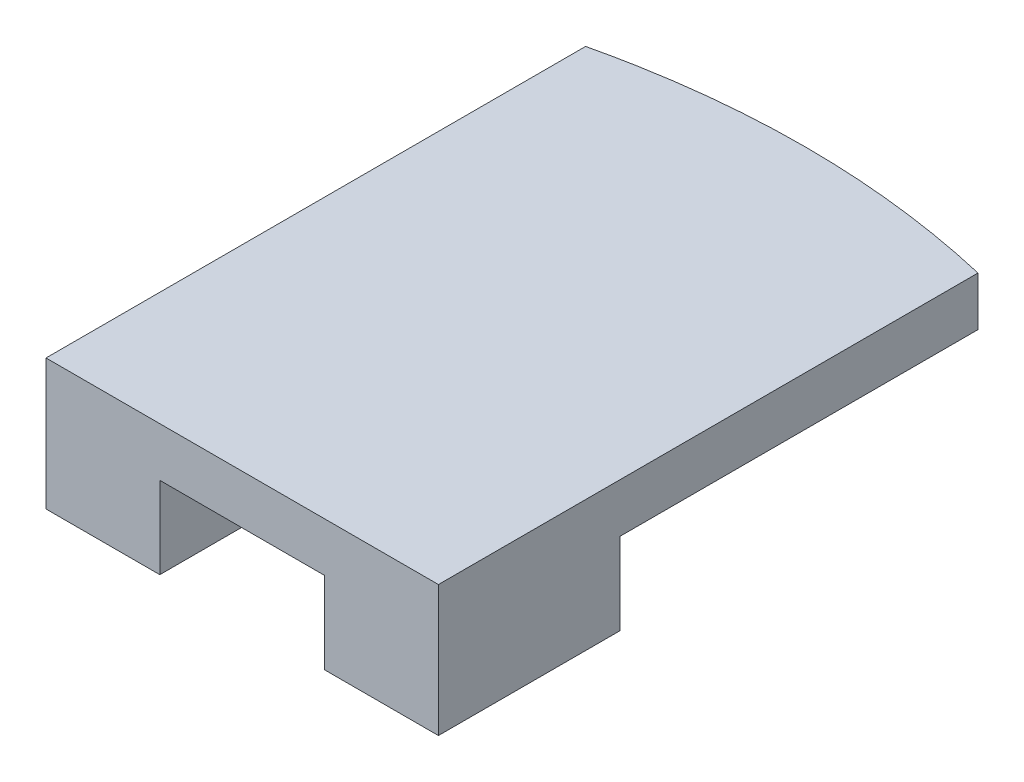
ISO-10303-21;
HEADER;
FILE_DESCRIPTION(('STEP AP214'),'2;1');
FILE_NAME('part.step','',(''),(''),'','','');
FILE_SCHEMA(('AUTOMOTIVE_DESIGN { 1 0 10303 214 1 1 1 1 }'));
ENDSEC;
DATA;
#1=APPLICATION_CONTEXT('core data for automotive mechanical design processes');
#2=APPLICATION_PROTOCOL_DEFINITION('international standard','automotive_design',2000,#1);
#3=PRODUCT_CONTEXT('',#1,'mechanical');
#4=PRODUCT('Part','Part','',(#3));
#5=PRODUCT_RELATED_PRODUCT_CATEGORY('part','',(#4));
#6=PRODUCT_DEFINITION_FORMATION('','',#4);
#7=PRODUCT_DEFINITION_CONTEXT('part definition',#1,'design');
#8=PRODUCT_DEFINITION('design','',#6,#7);
#9=PRODUCT_DEFINITION_SHAPE('','',#8);
#10=(LENGTH_UNIT() NAMED_UNIT(*) SI_UNIT(.MILLI.,.METRE.));
#11=(NAMED_UNIT(*) PLANE_ANGLE_UNIT() SI_UNIT($,.RADIAN.));
#12=(NAMED_UNIT(*) SI_UNIT($,.STERADIAN.) SOLID_ANGLE_UNIT());
#13=UNCERTAINTY_MEASURE_WITH_UNIT(LENGTH_MEASURE(1.E-05),#10,'distance_accuracy_value','');
#14=(GEOMETRIC_REPRESENTATION_CONTEXT(3) GLOBAL_UNCERTAINTY_ASSIGNED_CONTEXT((#13)) GLOBAL_UNIT_ASSIGNED_CONTEXT((#10,
#11,#12)) REPRESENTATION_CONTEXT('',''));
#15=CARTESIAN_POINT('',(0.,0.,0.));
#16=DIRECTION('',(0.,0.,1.));
#17=DIRECTION('',(1.,0.,0.));
#18=AXIS2_PLACEMENT_3D('',#15,#16,#17);
#19=CARTESIAN_POINT('',(12.,0.,-35.));
#20=DIRECTION('',(0.,1.,0.));
#21=DIRECTION('',(0.,0.,1.));
#22=AXIS2_PLACEMENT_3D('',#19,#20,#21);
#23=PLANE('',#22);
#24=DIRECTION('',(0.,0.,-1.));
#25=VECTOR('',#24,1.);
#26=CARTESIAN_POINT('',(17.0400117015381,0.,-0.600000000000002));
#27=LINE('',#26,#25);
#28=CARTESIAN_POINT('',(17.0400117015381,0.,-0.600000000000002));
#29=VERTEX_POINT('',#28);
#30=CARTESIAN_POINT('',(17.0400117015381,0.,-11.6947551513604));
#31=VERTEX_POINT('',#30);
#32=EDGE_CURVE('E138',#29,#31,#27,.T.);
#33=ORIENTED_EDGE('',*,*,#32,.F.);
#34=DIRECTION('',(-1.,0.,0.));
#35=VECTOR('',#34,1.);
#36=CARTESIAN_POINT('',(0.,0.,-0.6));
#37=LINE('',#36,#35);
#38=CARTESIAN_POINT('',(6.95998829846189,0.,-0.6));
#39=VERTEX_POINT('',#38);
#40=EDGE_CURVE('E122',#29,#39,#37,.T.);
#41=ORIENTED_EDGE('',*,*,#40,.T.);
#42=DIRECTION('',(0.,0.,1.));
#43=VECTOR('',#42,1.);
#44=CARTESIAN_POINT('',(6.95998829846189,0.,-0.600000000000003));
#45=LINE('',#44,#43);
#46=CARTESIAN_POINT('',(6.95998829846189,0.,-11.6947551513604));
#47=VERTEX_POINT('',#46);
#48=EDGE_CURVE('E155',#47,#39,#45,.T.);
#49=ORIENTED_EDGE('',*,*,#48,.F.);
#50=DIRECTION('',(1.,0.,0.));
#51=VECTOR('',#50,1.);
#52=CARTESIAN_POINT('',(0.,0.,-11.6947551513604));
#53=LINE('',#52,#51);
#54=CARTESIAN_POINT('',(0.,0.,-11.6947551513604));
#55=VERTEX_POINT('',#54);
#56=EDGE_CURVE('E150',#55,#47,#53,.T.);
#57=ORIENTED_EDGE('',*,*,#56,.F.);
#58=DIRECTION('',(0.,0.,1.));
#59=VECTOR('',#58,1.);
#60=CARTESIAN_POINT('',(0.,0.,0.));
#61=LINE('',#60,#59);
#62=CARTESIAN_POINT('',(0.,0.,-33.6));
#63=VERTEX_POINT('',#62);
#64=EDGE_CURVE('E179',#63,#55,#61,.T.);
#65=ORIENTED_EDGE('',*,*,#64,.F.);
#66=CARTESIAN_POINT('',(24.,0.,-33.6));
#67=CARTESIAN_POINT('',(12.,0.,-36.4));
#68=CARTESIAN_POINT('',(0.,0.,-33.6));
#69=B_SPLINE_CURVE_WITH_KNOTS('',2,(#66,#67,#68),.UNSPECIFIED.,.F.,.F.,(3,3),(0.,1.),.UNSPECIFIED.);
#70=CARTESIAN_POINT('',(24.,0.,-33.6));
#71=VERTEX_POINT('',#70);
#72=EDGE_CURVE('E184',#71,#63,#69,.T.);
#73=ORIENTED_EDGE('',*,*,#72,.F.);
#74=DIRECTION('',(0.,0.,-1.));
#75=VECTOR('',#74,1.);
#76=CARTESIAN_POINT('',(24.,0.,0.));
#77=LINE('',#76,#75);
#78=CARTESIAN_POINT('',(24.,0.,-11.6947551513604));
#79=VERTEX_POINT('',#78);
#80=EDGE_CURVE('E55',#79,#71,#77,.T.);
#81=ORIENTED_EDGE('',*,*,#80,.F.);
#82=DIRECTION('',(1.,0.,0.));
#83=VECTOR('',#82,1.);
#84=CARTESIAN_POINT('',(24.,0.,-11.6947551513604));
#85=LINE('',#84,#83);
#86=EDGE_CURVE('E50',#31,#79,#85,.T.);
#87=ORIENTED_EDGE('',*,*,#86,.F.);
#88=EDGE_LOOP('',(#33,#41,#49,#57,#65,#73,#81,#87));
#89=FACE_BOUND('',#88,.T.);
#90=ADVANCED_FACE('F35',(#89),#23,.F.);
#91=CARTESIAN_POINT('',(0.,3.,0.));
#92=DIRECTION('',(1.,0.,0.));
#93=DIRECTION('',(0.,0.,-1.));
#94=AXIS2_PLACEMENT_3D('',#91,#92,#93);
#95=PLANE('',#94);
#96=ORIENTED_EDGE('',*,*,#64,.T.);
#97=DIRECTION('',(0.,1.,0.));
#98=VECTOR('',#97,1.);
#99=CARTESIAN_POINT('',(0.,-5.,-11.6947551513604));
#100=LINE('',#99,#98);
#101=CARTESIAN_POINT('',(0.,-5.,-11.6947551513604));
#102=VERTEX_POINT('',#101);
#103=EDGE_CURVE('E172',#102,#55,#100,.T.);
#104=ORIENTED_EDGE('',*,*,#103,.F.);
#105=DIRECTION('',(0.,0.,-1.));
#106=VECTOR('',#105,1.);
#107=CARTESIAN_POINT('',(0.,-5.,-0.600000000000003));
#108=LINE('',#107,#106);
#109=CARTESIAN_POINT('',(0.,-5.,-0.600000000000003));
#110=VERTEX_POINT('',#109);
#111=EDGE_CURVE('E151',#110,#102,#108,.T.);
#112=ORIENTED_EDGE('',*,*,#111,.F.);
#113=DIRECTION('',(0.,1.,0.));
#114=VECTOR('',#113,1.);
#115=CARTESIAN_POINT('',(0.,0.,-0.6));
#116=LINE('',#115,#114);
#117=CARTESIAN_POINT('',(0.,3.,-0.6));
#118=VERTEX_POINT('',#117);
#119=EDGE_CURVE('E121',#110,#118,#116,.T.);
#120=ORIENTED_EDGE('',*,*,#119,.T.);
#121=DIRECTION('',(0.,0.,1.));
#122=VECTOR('',#121,1.);
#123=CARTESIAN_POINT('',(0.,3.,0.));
#124=LINE('',#123,#122);
#125=CARTESIAN_POINT('',(0.,3.,-33.6));
#126=VERTEX_POINT('',#125);
#127=EDGE_CURVE('E181',#126,#118,#124,.T.);
#128=ORIENTED_EDGE('',*,*,#127,.F.);
#129=DIRECTION('',(0.,-1.,0.));
#130=VECTOR('',#129,1.);
#131=CARTESIAN_POINT('',(0.,3.,-33.6));
#132=LINE('',#131,#130);
#133=EDGE_CURVE('E43',#126,#63,#132,.T.);
#134=ORIENTED_EDGE('',*,*,#133,.T.);
#135=EDGE_LOOP('',(#96,#104,#112,#120,#128,#134));
#136=FACE_BOUND('',#135,.T.);
#137=ADVANCED_FACE('F37',(#136),#95,.F.);
#138=CARTESIAN_POINT('',(24.,3.,0.));
#139=DIRECTION('',(-1.,0.,0.));
#140=DIRECTION('',(0.,0.,1.));
#141=AXIS2_PLACEMENT_3D('',#138,#139,#140);
#142=PLANE('',#141);
#143=DIRECTION('',(0.,0.,-1.));
#144=VECTOR('',#143,1.);
#145=CARTESIAN_POINT('',(24.,3.,0.));
#146=LINE('',#145,#144);
#147=CARTESIAN_POINT('',(24.,3.,-0.6));
#148=VERTEX_POINT('',#147);
#149=CARTESIAN_POINT('',(24.,3.,-33.6));
#150=VERTEX_POINT('',#149);
#151=EDGE_CURVE('E118',#148,#150,#146,.T.);
#152=ORIENTED_EDGE('',*,*,#151,.F.);
#153=DIRECTION('',(0.,1.,0.));
#154=VECTOR('',#153,1.);
#155=CARTESIAN_POINT('',(24.,0.,-0.6));
#156=LINE('',#155,#154);
#157=CARTESIAN_POINT('',(24.,-5.,-0.6));
#158=VERTEX_POINT('',#157);
#159=EDGE_CURVE('E111',#158,#148,#156,.T.);
#160=ORIENTED_EDGE('',*,*,#159,.F.);
#161=DIRECTION('',(0.,0.,1.));
#162=VECTOR('',#161,1.);
#163=CARTESIAN_POINT('',(24.,-5.,-0.6));
#164=LINE('',#163,#162);
#165=CARTESIAN_POINT('',(24.,-5.,-11.6947551513604));
#166=VERTEX_POINT('',#165);
#167=EDGE_CURVE('E116',#166,#158,#164,.T.);
#168=ORIENTED_EDGE('',*,*,#167,.F.);
#169=DIRECTION('',(0.,1.,0.));
#170=VECTOR('',#169,1.);
#171=CARTESIAN_POINT('',(24.,-5.,-11.6947551513604));
#172=LINE('',#171,#170);
#173=EDGE_CURVE('E143',#166,#79,#172,.T.);
#174=ORIENTED_EDGE('',*,*,#173,.T.);
#175=ORIENTED_EDGE('',*,*,#80,.T.);
#176=DIRECTION('',(0.,-1.,0.));
#177=VECTOR('',#176,1.);
#178=CARTESIAN_POINT('',(24.,3.,-33.6));
#179=LINE('',#178,#177);
#180=EDGE_CURVE('E11',#150,#71,#179,.T.);
#181=ORIENTED_EDGE('',*,*,#180,.F.);
#182=EDGE_LOOP('',(#152,#160,#168,#174,#175,#181));
#183=FACE_BOUND('',#182,.T.);
#184=ADVANCED_FACE('F113',(#183),#142,.F.);
#185=CARTESIAN_POINT('',(24.,3.,-33.6));
#186=CARTESIAN_POINT('',(12.,3.,-36.4));
#187=CARTESIAN_POINT('',(0.,3.,-33.6));
#188=B_SPLINE_CURVE_WITH_KNOTS('',2,(#185,#186,#187),.UNSPECIFIED.,.F.,.F.,(3,3),(0.,1.),.UNSPECIFIED.);
#189=DIRECTION('',(0.,-1.,0.));
#190=VECTOR('',#189,1.);
#191=SURFACE_OF_LINEAR_EXTRUSION('',#188,#190);
#192=ORIENTED_EDGE('',*,*,#72,.T.);
#193=ORIENTED_EDGE('',*,*,#133,.F.);
#194=EDGE_CURVE('E186',#150,#126,#188,.T.);
#195=ORIENTED_EDGE('',*,*,#194,.F.);
#196=ORIENTED_EDGE('',*,*,#180,.T.);
#197=EDGE_LOOP('',(#192,#193,#195,#196));
#198=FACE_BOUND('',#197,.T.);
#199=ADVANCED_FACE('F196',(#198),#191,.F.);
#200=CARTESIAN_POINT('',(12.,3.,-35.));
#201=DIRECTION('',(0.,1.,0.));
#202=DIRECTION('',(0.,0.,1.));
#203=AXIS2_PLACEMENT_3D('',#200,#201,#202);
#204=PLANE('',#203);
#205=DIRECTION('',(-1.,0.,0.));
#206=VECTOR('',#205,1.);
#207=CARTESIAN_POINT('',(0.,3.,-0.6));
#208=LINE('',#207,#206);
#209=EDGE_CURVE('E175',#148,#118,#208,.T.);
#210=ORIENTED_EDGE('',*,*,#209,.F.);
#211=ORIENTED_EDGE('',*,*,#151,.T.);
#212=ORIENTED_EDGE('',*,*,#194,.T.);
#213=ORIENTED_EDGE('',*,*,#127,.T.);
#214=EDGE_LOOP('',(#210,#211,#212,#213));
#215=FACE_BOUND('',#214,.T.);
#216=ADVANCED_FACE('F199',(#215),#204,.T.);
#217=CARTESIAN_POINT('',(0.,0.,-0.6));
#218=DIRECTION('',(0.,0.,-1.));
#219=DIRECTION('',(-1.,0.,0.));
#220=AXIS2_PLACEMENT_3D('',#217,#218,#219);
#221=PLANE('',#220);
#222=ORIENTED_EDGE('',*,*,#209,.T.);
#223=ORIENTED_EDGE('',*,*,#119,.F.);
#224=DIRECTION('',(-1.,0.,0.));
#225=VECTOR('',#224,1.);
#226=CARTESIAN_POINT('',(0.,-5.,-0.600000000000003));
#227=LINE('',#226,#225);
#228=CARTESIAN_POINT('',(6.95998829846189,-5.,-0.600000000000003));
#229=VERTEX_POINT('',#228);
#230=EDGE_CURVE('E159',#229,#110,#227,.T.);
#231=ORIENTED_EDGE('',*,*,#230,.F.);
#232=DIRECTION('',(0.,1.,0.));
#233=VECTOR('',#232,1.);
#234=CARTESIAN_POINT('',(6.95998829846189,-5.,-0.600000000000003));
#235=LINE('',#234,#233);
#236=EDGE_CURVE('E162',#229,#39,#235,.T.);
#237=ORIENTED_EDGE('',*,*,#236,.T.);
#238=ORIENTED_EDGE('',*,*,#40,.F.);
#239=DIRECTION('',(0.,1.,0.));
#240=VECTOR('',#239,1.);
#241=CARTESIAN_POINT('',(17.0400117015381,-5.,-0.600000000000002));
#242=LINE('',#241,#240);
#243=CARTESIAN_POINT('',(17.0400117015381,-5.,-0.600000000000002));
#244=VERTEX_POINT('',#243);
#245=EDGE_CURVE('E128',#244,#29,#242,.T.);
#246=ORIENTED_EDGE('',*,*,#245,.F.);
#247=DIRECTION('',(-1.,0.,0.));
#248=VECTOR('',#247,1.);
#249=CARTESIAN_POINT('',(24.,-5.,-0.6));
#250=LINE('',#249,#248);
#251=EDGE_CURVE('E125',#158,#244,#250,.T.);
#252=ORIENTED_EDGE('',*,*,#251,.F.);
#253=ORIENTED_EDGE('',*,*,#159,.T.);
#254=EDGE_LOOP('',(#222,#223,#231,#237,#238,#246,#252,#253));
#255=FACE_BOUND('',#254,.T.);
#256=ADVANCED_FACE('F126',(#255),#221,.F.);
#257=CARTESIAN_POINT('',(0.,-5.,-11.6947551513604));
#258=DIRECTION('',(0.,0.,1.));
#259=DIRECTION('',(1.,0.,0.));
#260=AXIS2_PLACEMENT_3D('',#257,#258,#259);
#261=PLANE('',#260);
#262=ORIENTED_EDGE('',*,*,#56,.T.);
#263=DIRECTION('',(0.,1.,0.));
#264=VECTOR('',#263,1.);
#265=CARTESIAN_POINT('',(6.95998829846189,-5.,-11.6947551513604));
#266=LINE('',#265,#264);
#267=CARTESIAN_POINT('',(6.95998829846189,-5.,-11.6947551513604));
#268=VERTEX_POINT('',#267);
#269=EDGE_CURVE('E169',#268,#47,#266,.T.);
#270=ORIENTED_EDGE('',*,*,#269,.F.);
#271=DIRECTION('',(1.,0.,0.));
#272=VECTOR('',#271,1.);
#273=CARTESIAN_POINT('',(0.,-5.,-11.6947551513604));
#274=LINE('',#273,#272);
#275=EDGE_CURVE('E154',#102,#268,#274,.T.);
#276=ORIENTED_EDGE('',*,*,#275,.F.);
#277=ORIENTED_EDGE('',*,*,#103,.T.);
#278=EDGE_LOOP('',(#262,#270,#276,#277));
#279=FACE_BOUND('',#278,.T.);
#280=ADVANCED_FACE('F236',(#279),#261,.F.);
#281=CARTESIAN_POINT('',(6.95998829846189,-5.,-0.600000000000003));
#282=DIRECTION('',(-1.,0.,0.));
#283=DIRECTION('',(0.,0.,1.));
#284=AXIS2_PLACEMENT_3D('',#281,#282,#283);
#285=PLANE('',#284);
#286=ORIENTED_EDGE('',*,*,#48,.T.);
#287=ORIENTED_EDGE('',*,*,#236,.F.);
#288=DIRECTION('',(0.,0.,1.));
#289=VECTOR('',#288,1.);
#290=CARTESIAN_POINT('',(6.95998829846189,-5.,-0.600000000000003));
#291=LINE('',#290,#289);
#292=EDGE_CURVE('E157',#268,#229,#291,.T.);
#293=ORIENTED_EDGE('',*,*,#292,.F.);
#294=ORIENTED_EDGE('',*,*,#269,.T.);
#295=EDGE_LOOP('',(#286,#287,#293,#294));
#296=FACE_BOUND('',#295,.T.);
#297=ADVANCED_FACE('F239',(#296),#285,.F.);
#298=CARTESIAN_POINT('',(0.,-5.,0.));
#299=DIRECTION('',(0.,-1.,0.));
#300=DIRECTION('',(0.,0.,-1.));
#301=AXIS2_PLACEMENT_3D('',#298,#299,#300);
#302=PLANE('',#301);
#303=ORIENTED_EDGE('',*,*,#111,.T.);
#304=ORIENTED_EDGE('',*,*,#275,.T.);
#305=ORIENTED_EDGE('',*,*,#292,.T.);
#306=ORIENTED_EDGE('',*,*,#230,.T.);
#307=EDGE_LOOP('',(#303,#304,#305,#306));
#308=FACE_BOUND('',#307,.T.);
#309=ADVANCED_FACE('F232',(#308),#302,.T.);
#310=CARTESIAN_POINT('',(17.0400117015381,-5.,-0.600000000000002));
#311=DIRECTION('',(1.,0.,0.));
#312=DIRECTION('',(0.,0.,-1.));
#313=AXIS2_PLACEMENT_3D('',#310,#311,#312);
#314=PLANE('',#313);
#315=ORIENTED_EDGE('',*,*,#32,.T.);
#316=DIRECTION('',(0.,1.,0.));
#317=VECTOR('',#316,1.);
#318=CARTESIAN_POINT('',(17.0400117015381,-5.,-11.6947551513604));
#319=LINE('',#318,#317);
#320=CARTESIAN_POINT('',(17.0400117015381,-5.,-11.6947551513604));
#321=VERTEX_POINT('',#320);
#322=EDGE_CURVE('E146',#321,#31,#319,.T.);
#323=ORIENTED_EDGE('',*,*,#322,.F.);
#324=DIRECTION('',(0.,0.,-1.));
#325=VECTOR('',#324,1.);
#326=CARTESIAN_POINT('',(17.0400117015381,-5.,-0.600000000000002));
#327=LINE('',#326,#325);
#328=EDGE_CURVE('E131',#244,#321,#327,.T.);
#329=ORIENTED_EDGE('',*,*,#328,.F.);
#330=ORIENTED_EDGE('',*,*,#245,.T.);
#331=EDGE_LOOP('',(#315,#323,#329,#330));
#332=FACE_BOUND('',#331,.T.);
#333=ADVANCED_FACE('F212',(#332),#314,.F.);
#334=CARTESIAN_POINT('',(24.,-5.,-11.6947551513604));
#335=DIRECTION('',(0.,0.,1.));
#336=DIRECTION('',(1.,0.,0.));
#337=AXIS2_PLACEMENT_3D('',#334,#335,#336);
#338=PLANE('',#337);
#339=ORIENTED_EDGE('',*,*,#86,.T.);
#340=ORIENTED_EDGE('',*,*,#173,.F.);
#341=DIRECTION('',(1.,0.,0.));
#342=VECTOR('',#341,1.);
#343=CARTESIAN_POINT('',(24.,-5.,-11.6947551513604));
#344=LINE('',#343,#342);
#345=EDGE_CURVE('E135',#321,#166,#344,.T.);
#346=ORIENTED_EDGE('',*,*,#345,.F.);
#347=ORIENTED_EDGE('',*,*,#322,.T.);
#348=EDGE_LOOP('',(#339,#340,#346,#347));
#349=FACE_BOUND('',#348,.T.);
#350=ADVANCED_FACE('F214',(#349),#338,.F.);
#351=CARTESIAN_POINT('',(0.,-5.,0.));
#352=DIRECTION('',(0.,1.,0.));
#353=DIRECTION('',(0.,0.,1.));
#354=AXIS2_PLACEMENT_3D('',#351,#352,#353);
#355=PLANE('',#354);
#356=ORIENTED_EDGE('',*,*,#167,.T.);
#357=ORIENTED_EDGE('',*,*,#251,.T.);
#358=ORIENTED_EDGE('',*,*,#328,.T.);
#359=ORIENTED_EDGE('',*,*,#345,.T.);
#360=EDGE_LOOP('',(#356,#357,#358,#359));
#361=FACE_BOUND('',#360,.T.);
#362=ADVANCED_FACE('F133',(#361),#355,.F.);
#363=CLOSED_SHELL('',(#90,#137,#184,#199,#216,#256,#280,#297,#309,#333,#350,#362));
#364=MANIFOLD_SOLID_BREP('B2',#363);
#365=ADVANCED_BREP_SHAPE_REPRESENTATION('',(#18,#364),#14);
#366=SHAPE_DEFINITION_REPRESENTATION(#9,#365);
ENDSEC;
END-ISO-10303-21;
